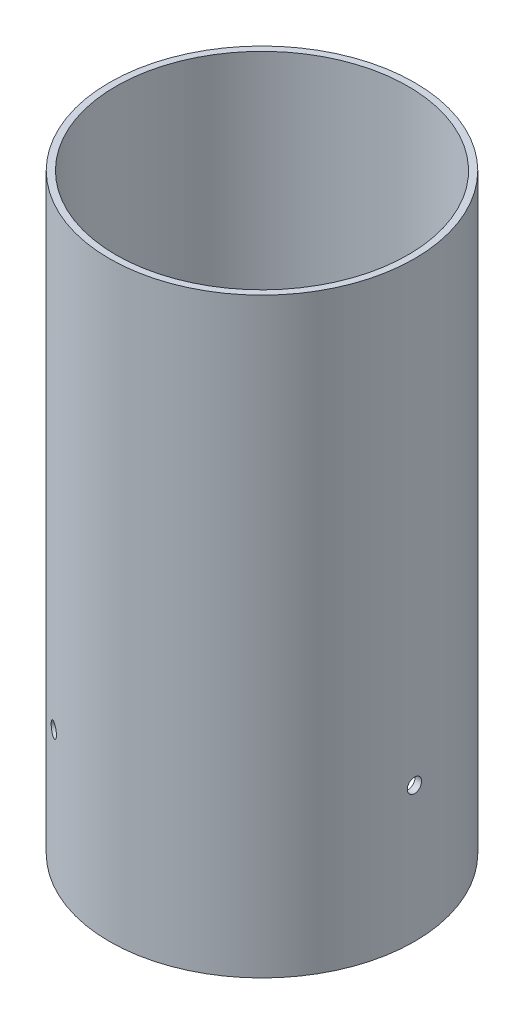
ISO-10303-21;
HEADER;
FILE_DESCRIPTION(('STEP AP214'),'2;1');
FILE_NAME('part.step','',(''),(''),'','','');
FILE_SCHEMA(('AUTOMOTIVE_DESIGN { 1 0 10303 214 1 1 1 1 }'));
ENDSEC;
DATA;
#1=APPLICATION_CONTEXT('core data for automotive mechanical design processes');
#2=APPLICATION_PROTOCOL_DEFINITION('international standard','automotive_design',2000,#1);
#3=PRODUCT_CONTEXT('',#1,'mechanical');
#4=PRODUCT('Part','Part','',(#3));
#5=PRODUCT_RELATED_PRODUCT_CATEGORY('part','',(#4));
#6=PRODUCT_DEFINITION_FORMATION('','',#4);
#7=PRODUCT_DEFINITION_CONTEXT('part definition',#1,'design');
#8=PRODUCT_DEFINITION('design','',#6,#7);
#9=PRODUCT_DEFINITION_SHAPE('','',#8);
#10=(LENGTH_UNIT() NAMED_UNIT(*) SI_UNIT(.MILLI.,.METRE.));
#11=(NAMED_UNIT(*) PLANE_ANGLE_UNIT() SI_UNIT($,.RADIAN.));
#12=(NAMED_UNIT(*) SI_UNIT($,.STERADIAN.) SOLID_ANGLE_UNIT());
#13=UNCERTAINTY_MEASURE_WITH_UNIT(LENGTH_MEASURE(1.E-05),#10,'distance_accuracy_value','');
#14=(GEOMETRIC_REPRESENTATION_CONTEXT(3) GLOBAL_UNCERTAINTY_ASSIGNED_CONTEXT((#13)) GLOBAL_UNIT_ASSIGNED_CONTEXT((#10,
#11,#12)) REPRESENTATION_CONTEXT('',''));
#15=CARTESIAN_POINT('',(0.,0.,0.));
#16=DIRECTION('',(0.,0.,1.));
#17=DIRECTION('',(1.,0.,0.));
#18=AXIS2_PLACEMENT_3D('',#15,#16,#17);
#19=CARTESIAN_POINT('',(0.,147.8153,0.));
#20=DIRECTION('',(0.,1.,0.));
#21=DIRECTION('',(0.,0.,1.));
#22=AXIS2_PLACEMENT_3D('',#19,#20,#21);
#23=PLANE('',#22);
#24=CARTESIAN_POINT('',(0.,147.8153,0.));
#25=DIRECTION('',(0.,1.,0.));
#26=DIRECTION('',(0.,0.,1.));
#27=AXIS2_PLACEMENT_3D('',#24,#25,#26);
#28=CIRCLE('',#27,38.1381);
#29=CARTESIAN_POINT('',(0.,147.8153,38.1381));
#30=VERTEX_POINT('',#29);
#31=EDGE_CURVE('E10',#30,#30,#28,.T.);
#32=ORIENTED_EDGE('',*,*,#31,.T.);
#33=EDGE_LOOP('',(#32));
#34=FACE_BOUND('',#33,.T.);
#35=CARTESIAN_POINT('',(0.,147.8153,0.));
#36=DIRECTION('',(0.,1.,0.));
#37=DIRECTION('',(0.,0.,1.));
#38=AXIS2_PLACEMENT_3D('',#35,#36,#37);
#39=CIRCLE('',#38,36.5125);
#40=CARTESIAN_POINT('',(0.,147.8153,36.5125));
#41=VERTEX_POINT('',#40);
#42=EDGE_CURVE('E47',#41,#41,#39,.T.);
#43=ORIENTED_EDGE('',*,*,#42,.F.);
#44=EDGE_LOOP('',(#43));
#45=FACE_BOUND('',#44,.T.);
#46=ADVANCED_FACE('F36',(#34,#45),#23,.T.);
#47=CARTESIAN_POINT('',(0.,0.,0.));
#48=DIRECTION('',(0.,1.,0.));
#49=DIRECTION('',(0.,0.,1.));
#50=AXIS2_PLACEMENT_3D('',#47,#48,#49);
#51=PLANE('',#50);
#52=CARTESIAN_POINT('',(0.,0.,0.));
#53=DIRECTION('',(0.,1.,0.));
#54=DIRECTION('',(0.,0.,1.));
#55=AXIS2_PLACEMENT_3D('',#52,#53,#54);
#56=CIRCLE('',#55,38.1381);
#57=CARTESIAN_POINT('',(0.,0.,38.1381));
#58=VERTEX_POINT('',#57);
#59=EDGE_CURVE('E40',#58,#58,#56,.T.);
#60=ORIENTED_EDGE('',*,*,#59,.F.);
#61=EDGE_LOOP('',(#60));
#62=FACE_BOUND('',#61,.T.);
#63=CARTESIAN_POINT('',(0.,0.,0.));
#64=DIRECTION('',(0.,1.,0.));
#65=DIRECTION('',(0.,0.,1.));
#66=AXIS2_PLACEMENT_3D('',#63,#64,#65);
#67=CIRCLE('',#66,36.5125);
#68=CARTESIAN_POINT('',(0.,0.,36.5125));
#69=VERTEX_POINT('',#68);
#70=EDGE_CURVE('E49',#69,#69,#67,.T.);
#71=ORIENTED_EDGE('',*,*,#70,.T.);
#72=EDGE_LOOP('',(#71));
#73=FACE_BOUND('',#72,.T.);
#74=ADVANCED_FACE('F119',(#62,#73),#51,.F.);
#75=CARTESIAN_POINT('',(0.,147.8153,0.));
#76=DIRECTION('',(0.,-1.,0.));
#77=DIRECTION('',(0.,0.,-1.));
#78=AXIS2_PLACEMENT_3D('',#75,#76,#77);
#79=CYLINDRICAL_SURFACE('',#78,38.1381);
#80=CARTESIAN_POINT('',(-17.5014632336155,33.8074,33.8852985274205));
#81=CARTESIAN_POINT('',(-17.501467349219,33.9076578687469,33.8852968008197));
#82=CARTESIAN_POINT('',(-17.508999065726,34.0079870339223,33.8814096230945));
#83=CARTESIAN_POINT('',(-17.5389215941936,34.205878197048,33.8659293942136));
#84=CARTESIAN_POINT('',(-17.5613299602515,34.3034367837977,33.85432723954));
#85=CARTESIAN_POINT('',(-17.6203141855438,34.4928914651225,33.8236647641002));
#86=CARTESIAN_POINT('',(-17.6568828784673,34.5847903967336,33.8046082158315));
#87=CARTESIAN_POINT('',(-17.7430638212488,34.7603432783211,33.7594536817781));
#88=CARTESIAN_POINT('',(-17.792672972035,34.8439991807722,33.7333573689586));
#89=CARTESIAN_POINT('',(-17.9034840121713,35.0007921425403,33.6746767440669));
#90=CARTESIAN_POINT('',(-17.9646950271793,35.0739208412828,33.6420873236829));
#91=CARTESIAN_POINT('',(-18.0968533022114,35.2075123586161,33.5711808496157));
#92=CARTESIAN_POINT('',(-18.1678009575859,35.2679746626434,33.5328635633504));
#93=CARTESIAN_POINT('',(-18.3173592830159,35.3745390488251,33.4514015191992));
#94=CARTESIAN_POINT('',(-18.3959733221843,35.4206347796843,33.4082546376291));
#95=CARTESIAN_POINT('',(-18.5585260587089,35.4971167209652,33.3182293245103));
#96=CARTESIAN_POINT('',(-18.6424647194058,35.5275030395305,33.2713509186521));
#97=CARTESIAN_POINT('',(-18.8131603751818,35.5716819567595,33.1751300658714));
#98=CARTESIAN_POINT('',(-18.8999152369714,35.5854868280182,33.1257894695229));
#99=CARTESIAN_POINT('',(-19.0738088012202,35.5961488477628,33.0259676432805));
#100=CARTESIAN_POINT('',(-19.1609475009398,35.5930061170072,32.9754864215167));
#101=CARTESIAN_POINT('',(-19.3330697199145,35.5698723474202,32.8748691177054));
#102=CARTESIAN_POINT('',(-19.418054875546,35.5498945218934,32.8247327960607));
#103=CARTESIAN_POINT('',(-19.583569892321,35.4936781366245,32.7262546252417));
#104=CARTESIAN_POINT('',(-19.6640997364757,35.4574395148824,32.6779127829103));
#105=CARTESIAN_POINT('',(-19.8185219457185,35.3697151326098,32.5844904179342));
#106=CARTESIAN_POINT('',(-19.892411671933,35.3182233448836,32.5394111932713));
#107=CARTESIAN_POINT('',(-20.0315166435133,35.2014587034356,32.4539625790467));
#108=CARTESIAN_POINT('',(-20.0967318355649,35.1361857650204,32.4135932184323));
#109=CARTESIAN_POINT('',(-20.2168010405188,34.9936369669281,32.3388411258981));
#110=CARTESIAN_POINT('',(-20.2716450461268,34.9163496440811,32.3044641786123));
#111=CARTESIAN_POINT('',(-20.369438174186,34.7520062782388,32.2428908495348));
#112=CARTESIAN_POINT('',(-20.4123872937555,34.6649502328769,32.2156944694826));
#113=CARTESIAN_POINT('',(-20.4852583357616,34.4835337335853,32.1694068226873));
#114=CARTESIAN_POINT('',(-20.5151798986683,34.3891730781501,32.1503157796327));
#115=CARTESIAN_POINT('',(-20.561206444117,34.1958290196872,32.1208999508396));
#116=CARTESIAN_POINT('',(-20.577311517821,34.0968456471649,32.1105751072611));
#117=CARTESIAN_POINT('',(-20.595273484249,33.8971665940379,32.0990575866162));
#118=CARTESIAN_POINT('',(-20.597143893939,33.7964726288875,32.0978562460472));
#119=CARTESIAN_POINT('',(-20.5866231403947,33.5961422470756,32.1046049164172));
#120=CARTESIAN_POINT('',(-20.5742320184312,33.4965058273547,32.1125549008735));
#121=CARTESIAN_POINT('',(-20.5355220520146,33.3011638380275,32.1373229722597));
#122=CARTESIAN_POINT('',(-20.50920939702,33.2054565419093,32.1541371182066));
#123=CARTESIAN_POINT('',(-20.4433503288636,33.0206364223301,32.196049659695));
#124=CARTESIAN_POINT('',(-20.4038038486634,32.9315236322774,32.2211480972021));
#125=CARTESIAN_POINT('',(-20.3124821865116,32.7623483055533,32.278795607632));
#126=CARTESIAN_POINT('',(-20.2606977969633,32.6822926507096,32.3113502899361));
#127=CARTESIAN_POINT('',(-20.1462864687058,32.5335732855632,32.3828094851312));
#128=CARTESIAN_POINT('',(-20.0836594686947,32.4649096396729,32.421714033923));
#129=CARTESIAN_POINT('',(-19.9491818321175,32.3408695739021,32.5046311874835));
#130=CARTESIAN_POINT('',(-19.8773240734296,32.2855035096205,32.5486477339441));
#131=CARTESIAN_POINT('',(-19.7263669675379,32.1897010321337,32.6403570320063));
#132=CARTESIAN_POINT('',(-19.6472676489548,32.1492645599254,32.6880497690783));
#133=CARTESIAN_POINT('',(-19.4840319330606,32.084487234282,32.7856096633245));
#134=CARTESIAN_POINT('',(-19.3998976295519,32.0601397402629,32.8354759143297));
#135=CARTESIAN_POINT('',(-19.2289060520162,32.028209756078,32.9359024547704));
#136=CARTESIAN_POINT('',(-19.1420487908613,32.0206271866717,32.9864627409244));
#137=CARTESIAN_POINT('',(-18.9681508668178,32.022443068198,33.0867645792259));
#138=CARTESIAN_POINT('',(-18.8811104591919,32.0318252655729,33.1365068690075));
#139=CARTESIAN_POINT('',(-18.7092530191418,32.0672707808457,33.2338423843089));
#140=CARTESIAN_POINT('',(-18.6244359909555,32.0933341305366,33.2814356057326));
#141=CARTESIAN_POINT('',(-18.4594798888871,32.1613988900873,33.3732106648531));
#142=CARTESIAN_POINT('',(-18.3793408605228,32.2034004549993,33.4173924693574));
#143=CARTESIAN_POINT('',(-18.2260878657308,32.3021463301724,33.5012243290482));
#144=CARTESIAN_POINT('',(-18.1529736764123,32.3588901724648,33.5408745280253));
#145=CARTESIAN_POINT('',(-18.015868143754,32.4855672360272,33.6147177026454));
#146=CARTESIAN_POINT('',(-17.9518846003812,32.5555116169684,33.6489060153489));
#147=CARTESIAN_POINT('',(-17.8350110289078,32.7066001733453,33.7109988811533));
#148=CARTESIAN_POINT('',(-17.7821237373999,32.7877471034271,33.7389018842759));
#149=CARTESIAN_POINT('',(-17.6890181436651,32.9589949189407,33.7878097201873));
#150=CARTESIAN_POINT('',(-17.6488112777457,33.0491037912539,33.8088083267147));
#151=CARTESIAN_POINT('',(-17.5823942894019,33.2355925870745,33.8433966689575));
#152=CARTESIAN_POINT('',(-17.5561676040917,33.3319649373638,33.8569951722755));
#153=CARTESIAN_POINT('',(-17.5254064854518,33.4920150071967,33.8729237871435));
#154=CARTESIAN_POINT('',(-17.516439932421,33.5546556126158,33.8775596798369));
#155=CARTESIAN_POINT('',(-17.5044670077013,33.6806546460333,33.8837475946384));
#156=CARTESIAN_POINT('',(-17.5014606315708,33.7440130734968,33.8852996190447));
#157=CARTESIAN_POINT('',(-17.5014632336155,33.8074,33.8852985274205));
#158=B_SPLINE_CURVE_WITH_KNOTS('',3,(#80,#81,#82,#83,#84,#85,#86,#87,#88,#89,#90,#91,#92,#93,
#94,#95,#96,#97,#98,#99,#100,#101,#102,#103,#104,#105,#106,#107,#108,#109,#110,#111,#112,#113,
#114,#115,#116,#117,#118,#119,#120,#121,#122,#123,#124,#125,#126,#127,#128,#129,#130,#131,#132,
#133,#134,#135,#136,#137,#138,#139,#140,#141,#142,#143,#144,#145,#146,#147,#148,#149,#150,#151,
#152,#153,#154,#155,#156,#157),.UNSPECIFIED.,.T.,.F.,(4,2,2,2,2,2,2,2,2,2,2,2,2,2,2,2,2,2,2,2,2,
2,2,2,2,2,2,2,2,2,2,2,2,2,2,2,2,2,4),(0.,0.30054222269631,0.601439709975831,0.902185116537959,
1.20285911531018,1.50377060360109,1.80469431384009,2.1057508708664,2.40680535539062,
2.70763687982766,3.00846626072007,3.30905975033448,3.60965438607756,3.9103679587644,
4.21108337957105,4.51208750037112,4.8130916940894,5.11410419428654,5.41511470836723,
5.71583935288382,6.01656312714919,6.31715331302587,6.61774502161876,6.91856361444067,
7.21938390808641,7.52043771383772,7.82149032978512,8.12241861117601,8.42334547020756,
8.72398417080085,9.0246234443924,9.32526564277497,9.62589829894312,9.92678625628239,
10.2277483325598,10.5289810714218,10.8298561299779,11.0198707614112,11.2098852512392),.UNSPECIFIED.);
#159=CARTESIAN_POINT('',(-17.5014632336155,33.8074,33.8852985274205));
#160=VERTEX_POINT('',#159);
#161=EDGE_CURVE('E101',#160,#160,#158,.T.);
#162=ORIENTED_EDGE('',*,*,#161,.F.);
#163=EDGE_LOOP('',(#162));
#164=FACE_BOUND('',#163,.T.);
#165=CARTESIAN_POINT('',(-20.5947977227576,33.8074,-32.0993610274207));
#166=CARTESIAN_POINT('',(-20.5947941696758,33.9076578687469,-32.0993637283375));
#167=CARTESIAN_POINT('',(-20.5876619167632,34.0079870339223,-32.1039427973041));
#168=CARTESIAN_POINT('',(-20.5592943810622,34.205878197048,-32.122116352662));
#169=CARTESIAN_POINT('',(-20.5380424373473,34.3034367837977,-32.1357214895887));
#170=CARTESIAN_POINT('',(-20.4819958420273,34.4928914651225,-32.1714720893944));
#171=CARTESIAN_POINT('',(-20.4472080406564,34.5847903967336,-32.193613232315));
#172=CARTESIAN_POINT('',(-20.3650125956794,34.7603432783211,-32.2456708510592));
#173=CARTESIAN_POINT('',(-20.3176079504394,34.8439991807721,-32.2755854794905));
#174=CARTESIAN_POINT('',(-20.2113835185052,35.0007921425403,-32.3422103428224));
#175=CARTESIAN_POINT('',(-20.152554745054,35.0739208412828,-32.3789259266187));
#176=CARTESIAN_POINT('',(-20.025068799703,35.2075123586161,-32.4579251130833));
#177=CARTESIAN_POINT('',(-19.9564112287059,35.2679746626434,-32.500208941844));
#178=CARTESIAN_POINT('',(-19.8110838663118,35.3745390488251,-32.5889992289381));
#179=CARTESIAN_POINT('',(-19.7344105511938,35.4206347796843,-32.6355075431671));
#180=CARTESIAN_POINT('',(-19.575169974787,35.4971167209652,-32.7312696858926));
#181=CARTESIAN_POINT('',(-19.4926027540764,35.5275030395305,-32.7805234954867));
#182=CARTESIAN_POINT('',(-19.3239252233066,35.5716819567595,-32.880239843314));
#183=CARTESIAN_POINT('',(-19.237817582536,35.5854868280182,-32.9307014593514));
#184=CARTESIAN_POINT('',(-19.0644225630336,35.5961488477628,-33.0313867904242));
#185=CARTESIAN_POINT('',(-18.9771351927122,35.5930061170072,-33.0816105071523));
#186=CARTESIAN_POINT('',(-18.803936942064,35.5698723474202,-33.1803640694344));
#187=CARTESIAN_POINT('',(-18.7180250360516,35.5498945218934,-33.2288952123336));
#188=CARTESIAN_POINT('',(-18.5499829300166,35.4936781366245,-33.322996336159));
#189=CARTESIAN_POINT('',(-18.4678527444145,35.4574395148824,-33.3685663057941));
#190=CARTESIAN_POINT('',(-18.3097354984422,35.3697151326098,-33.4555886794188));
#191=CARTESIAN_POINT('',(-18.233750881594,35.3182233448836,-33.4970394470678));
#192=CARTESIAN_POINT('',(-18.0901977251672,35.2014587034356,-33.5747835791368));
#193=CARTESIAN_POINT('',(-18.0226292373148,35.1361857650204,-33.6110769118589));
#194=CARTESIAN_POINT('',(-17.8978574237172,34.9936369669281,-33.6776838472941));
#195=CARTESIAN_POINT('',(-17.8406641112591,34.9163496440811,-33.7079916757531));
#196=CARTESIAN_POINT('',(-17.7384434800528,34.7520062782388,-33.7618963444291));
#197=CARTESIAN_POINT('',(-17.6934161642519,34.6649502328769,-33.7854931830203));
#198=CARTESIAN_POINT('',(-17.6168943652427,34.4835337335853,-33.8254575332002));
#199=CARTESIAN_POINT('',(-17.5854002555193,34.3891730781501,-33.841824845271));
#200=CARTESIAN_POINT('',(-17.5369121277868,34.1958290196872,-33.8669770884814));
#201=CARTESIAN_POINT('',(-17.5199180141057,34.0968456471649,-33.8757620696497));
#202=CARTESIAN_POINT('',(-17.5009625654246,33.8971665940379,-33.8855588285559));
#203=CARTESIAN_POINT('',(-17.4989869691283,33.7964726288875,-33.8865779805784));
#204=CARTESIAN_POINT('',(-17.5100918658825,33.5961422470756,-33.8808410759271));
#205=CARTESIAN_POINT('',(-17.5231723153632,33.4965058273547,-33.8740850417534));
#206=CARTESIAN_POINT('',(-17.5639770775947,33.3011638380275,-33.8529452631501));
#207=CARTESIAN_POINT('',(-17.5916948826249,33.2054565419094,-33.8385649084572));
#208=CARTESIAN_POINT('',(-17.6609217423693,33.0206364223301,-33.8024855531084));
#209=CARTESIAN_POINT('',(-17.7024308669458,32.9315236322775,-33.7807865153784));
#210=CARTESIAN_POINT('',(-17.7980159065189,32.7623483055533,-33.730523391254));
#211=CARTESIAN_POINT('',(-17.8521012831806,32.6822926507096,-33.7019541355377));
#212=CARTESIAN_POINT('',(-17.9711924256823,32.5335732855632,-33.6386006163836));
#213=CARTESIAN_POINT('',(-18.0361982532643,32.4649096396729,-33.603816317807));
#214=CARTESIAN_POINT('',(-18.1752454329457,32.3408695739021,-33.5288138450706));
#215=CARTESIAN_POINT('',(-18.2492937597114,32.2855035096205,-33.4885914738182));
#216=CARTESIAN_POINT('',(-18.4041948945424,32.1897010321337,-33.4037134342652));
#217=CARTESIAN_POINT('',(-18.4850476757143,32.1492645599254,-33.3590577834863));
#218=CARTESIAN_POINT('',(-18.6511548804692,32.084487234282,-33.2664714538401));
#219=CARTESIAN_POINT('',(-18.7364074723854,32.0601397402629,-33.2185421351744));
#220=CARTESIAN_POINT('',(-18.9088751963892,32.028209756078,-33.1206723554156));
#221=CARTESIAN_POINT('',(-18.9960903191986,32.0206271866717,-33.0707319038294));
#222=CARTESIAN_POINT('',(-19.1699032212357,32.022443068198,-32.970282803093));
#223=CARTESIAN_POINT('',(-19.2565015116419,32.0318252655729,-32.9197747438241));
#224=CARTESIAN_POINT('',(-19.4267252606085,32.0672707808457,-32.8196095925621));
#225=CARTESIAN_POINT('',(-19.5103507135025,32.0933341305366,-32.7699525021911));
#226=CARTESIAN_POINT('',(-19.6723082971688,32.1613988900873,-32.6729838568508));
#227=CARTESIAN_POINT('',(-19.7506403764367,32.2034004549993,-32.6256723247049));
#228=CARTESIAN_POINT('',(-19.8998673939714,32.3021463301724,-32.5348672678544));
#229=CARTESIAN_POINT('',(-19.9707625682099,32.3588901724648,-32.491373622016));
#230=CARTESIAN_POINT('',(-20.1032653996562,32.4855672360272,-32.4095583350445));
#231=CARTESIAN_POINT('',(-20.1648651186564,32.5555116169684,-32.3712411174113));
#232=CARTESIAN_POINT('',(-20.2770759035736,32.7066001733453,-32.3010720683865));
#233=CARTESIAN_POINT('',(-20.3276842588735,32.7877471034271,-32.2692218319646));
#234=CARTESIAN_POINT('',(-20.4165924840843,32.9589949189407,-32.2130439405115));
#235=CARTESIAN_POINT('',(-20.4548812437407,33.0491037912539,-32.1887230764825));
#236=CARTESIAN_POINT('',(-20.5180441209697,33.2355925870745,-32.1484984484553));
#237=CARTESIAN_POINT('',(-20.5429341129517,33.3319649373638,-32.1325847243787));
#238=CARTESIAN_POINT('',(-20.5721092573945,33.4920150071967,-32.1139091216217));
#239=CARTESIAN_POINT('',(-20.5806073347516,33.5546556126158,-32.1084618052593));
#240=CARTESIAN_POINT('',(-20.5919526885259,33.6806546460333,-32.1011869056952));
#241=CARTESIAN_POINT('',(-20.5947999691543,33.7440130734968,-32.099359319796));
#242=CARTESIAN_POINT('',(-20.5947977227576,33.8074,-32.0993610274207));
#243=B_SPLINE_CURVE_WITH_KNOTS('',3,(#165,#166,#167,#168,#169,#170,#171,#172,#173,#174,#175,
#176,#177,#178,#179,#180,#181,#182,#183,#184,#185,#186,#187,#188,#189,#190,#191,#192,#193,#194,
#195,#196,#197,#198,#199,#200,#201,#202,#203,#204,#205,#206,#207,#208,#209,#210,#211,#212,#213,
#214,#215,#216,#217,#218,#219,#220,#221,#222,#223,#224,#225,#226,#227,#228,#229,#230,#231,#232,
#233,#234,#235,#236,#237,#238,#239,#240,#241,#242),.UNSPECIFIED.,.T.,.F.,(4,2,2,2,2,2,2,2,2,2,2,
2,2,2,2,2,2,2,2,2,2,2,2,2,2,2,2,2,2,2,2,2,2,2,2,2,2,2,4),(0.,0.30054222269631,0.601439709975832,
0.902185116537959,1.20285911531018,1.50377060360109,1.80469431384009,2.10575087086639,
2.40680535539062,2.70763687982766,3.00846626072008,3.30905975033448,3.60965438607756,
3.9103679587644,4.21108337957105,4.51208750037112,4.81309169408941,5.11410419428654,
5.41511470836724,5.71583935288383,6.01656312714919,6.31715331302586,6.61774502161876,
6.91856361444067,7.21938390808641,7.52043771383773,7.82149032978512,8.12241861117601,
8.42334547020756,8.72398417080085,9.0246234443924,9.32526564277497,9.62589829894312,
9.92678625628239,10.2277483325598,10.5289810714218,10.8298561299779,11.0198707614112,
11.2098852512392),.UNSPECIFIED.);
#244=CARTESIAN_POINT('',(-20.5947977227576,33.8074,-32.0993610274207));
#245=VERTEX_POINT('',#244);
#246=EDGE_CURVE('E78',#245,#245,#243,.T.);
#247=ORIENTED_EDGE('',*,*,#246,.F.);
#248=EDGE_LOOP('',(#247));
#249=FACE_BOUND('',#248,.T.);
#250=CARTESIAN_POINT('',(38.0962609563733,33.8074,-1.7859375));
#251=CARTESIAN_POINT('',(38.0962615188949,33.9076578687469,-1.78593307248244));
#252=CARTESIAN_POINT('',(38.0966609824894,34.0079870339223,-1.77746682579068));
#253=CARTESIAN_POINT('',(38.0982159752559,34.205878197048,-1.74381304155182));
#254=CARTESIAN_POINT('',(38.0993723975989,34.3034367837977,-1.71860574995165));
#255=CARTESIAN_POINT('',(38.1023100275712,34.4928914651225,-1.65219267470606));
#256=CARTESIAN_POINT('',(38.1040909191239,34.5847903967336,-1.61099498351676));
#257=CARTESIAN_POINT('',(38.1080764169283,34.7603432783211,-1.5137828307192));
#258=CARTESIAN_POINT('',(38.1102809224746,34.8439991807722,-1.45777188946837));
#259=CARTESIAN_POINT('',(38.1148675306766,35.0007921425403,-1.33246640124479));
#260=CARTESIAN_POINT('',(38.1172497722334,35.0739208412828,-1.26316139706439));
#261=CARTESIAN_POINT('',(38.1219221019145,35.2075123586161,-1.11325573653268));
#262=CARTESIAN_POINT('',(38.124212186292,35.2679746626434,-1.03265462150673));
#263=CARTESIAN_POINT('',(38.1284431493278,35.3745390488251,-0.862402290261317));
#264=CARTESIAN_POINT('',(38.1303838733782,35.4206347796843,-0.772747094462273));
#265=CARTESIAN_POINT('',(38.133696033496,35.4971167209652,-0.586959638617963));
#266=CARTESIAN_POINT('',(38.1350674734823,35.5275030395305,-0.490827423165673));
#267=CARTESIAN_POINT('',(38.1370855984884,35.5716819567595,-0.294890222557718));
#268=CARTESIAN_POINT('',(38.1377328195076,35.5854868280182,-0.195088010171746));
#269=CARTESIAN_POINT('',(38.1382313642539,35.5961488477628,0.00541914714346489));
#270=CARTESIAN_POINT('',(38.1380826936522,35.5930061170072,0.106124085635308));
#271=CARTESIAN_POINT('',(38.1370066619786,35.5698723474202,0.305494951728732));
#272=CARTESIAN_POINT('',(38.1360799115978,35.5498945218934,0.404162416272602));
#273=CARTESIAN_POINT('',(38.1335528223378,35.4936781366245,0.596741710917084));
#274=CARTESIAN_POINT('',(38.1319524808904,35.4574395148824,0.690653522883571));
#275=CARTESIAN_POINT('',(38.1282574441608,35.3697151326098,0.871098261484329));
#276=CARTESIAN_POINT('',(38.1261625535272,35.3182233448836,0.957628253796231));
#277=CARTESIAN_POINT('',(38.1217143686807,35.2014587034356,1.12082100008981));
#278=CARTESIAN_POINT('',(38.1193610728798,35.1361857650204,1.19748369342633));
#279=CARTESIAN_POINT('',(38.1146584642361,34.9936369669281,1.33884272139567));
#280=CARTESIAN_POINT('',(38.1123091573861,34.9163496440811,1.40352749714048));
#281=CARTESIAN_POINT('',(38.107881654239,34.7520062782388,1.519005494894));
#282=CARTESIAN_POINT('',(38.1058034580075,34.6649502328769,1.56979871353748));
#283=CARTESIAN_POINT('',(38.1021527010044,34.4835337335853,1.65605071051264));
#284=CARTESIAN_POINT('',(38.1005801541877,34.3891730781501,1.69150906563811));
#285=CARTESIAN_POINT('',(38.0981185719039,34.1958290196872,1.74607713764162));
#286=CARTESIAN_POINT('',(38.0972295319268,34.0968456471649,1.76518696238839));
#287=CARTESIAN_POINT('',(38.0962360496738,33.8971665940379,1.78650124193938));
#288=CARTESIAN_POINT('',(38.0961308630674,33.7964726288875,1.78872173453091));
#289=CARTESIAN_POINT('',(38.0967150062774,33.5961422470756,1.77623615950963));
#290=CARTESIAN_POINT('',(38.0974043337945,33.4965058273547,1.76153014087967));
#291=CARTESIAN_POINT('',(38.0994991296094,33.3011638380275,1.71562229089013));
#292=CARTESIAN_POINT('',(38.1009042796451,33.2054565419094,1.68442779025039));
#293=CARTESIAN_POINT('',(38.104272071233,33.0206364223301,1.60643589341315));
#294=CARTESIAN_POINT('',(38.1062347156094,32.9315236322775,1.55963841817599));
#295=CARTESIAN_POINT('',(38.1104980930306,32.7623483055533,1.45172778362177));
#296=CARTESIAN_POINT('',(38.112799080144,32.6822926507096,1.39060384560135));
#297=CARTESIAN_POINT('',(38.1174788943882,32.5335732855632,1.2557911312521));
#298=CARTESIAN_POINT('',(38.1198577219591,32.4649096396729,1.18210228388381));
#299=CARTESIAN_POINT('',(38.1244272650634,32.3408695739021,1.02418265758683));
#300=CARTESIAN_POINT('',(38.1266178331412,32.2855035096205,0.939943739873793));
#301=CARTESIAN_POINT('',(38.1305618620804,32.1897010321337,0.763356402258667));
#302=CARTESIAN_POINT('',(38.1323153246693,32.1492645599254,0.671008014407706));
#303=CARTESIAN_POINT('',(38.1351868135299,32.084487234282,0.480861790515269));
#304=CARTESIAN_POINT('',(38.1363051019375,32.0601397402629,0.383066220844478));
#305=CARTESIAN_POINT('',(38.1377812484055,32.028209756078,0.184769900644984));
#306=CARTESIAN_POINT('',(38.1381391100601,32.0206271866717,0.084269162904701));
#307=CARTESIAN_POINT('',(38.1380540880537,32.022443068198,-0.116481776133133));
#308=CARTESIAN_POINT('',(38.137611970834,32.0318252655729,-0.21673212518367));
#309=CARTESIAN_POINT('',(38.1359782797504,32.0672707808457,-0.414232791747113));
#310=CARTESIAN_POINT('',(38.1347867044582,32.0933341305366,-0.511483103541785));
#311=CARTESIAN_POINT('',(38.1317881860561,32.1613988900873,-0.700226808002504));
#312=CARTESIAN_POINT('',(38.1299812369597,32.2034004549993,-0.791720144652742));
#313=CARTESIAN_POINT('',(38.1259552597024,32.3021463301724,-0.966357061194046));
#314=CARTESIAN_POINT('',(38.1237362446224,32.3588901724648,-1.04950090600953));
#315=CARTESIAN_POINT('',(38.1191335434104,32.4855672360272,-1.20515936760108));
#316=CARTESIAN_POINT('',(38.1167497190378,32.5555116169684,-1.27766489793787));
#317=CARTESIAN_POINT('',(38.1120869324815,32.7066001733453,-1.40992681276709));
#318=CARTESIAN_POINT('',(38.1098079962735,32.7877471034271,-1.46968005231157));
#319=CARTESIAN_POINT('',(38.1056106277495,32.9589949189407,-1.57476577967603));
#320=CARTESIAN_POINT('',(38.1036925214866,33.0491037912539,-1.62008525023241));
#321=CARTESIAN_POINT('',(38.1004384103717,33.2355925870745,-1.69489822050243));
#322=CARTESIAN_POINT('',(38.0991017170436,33.3319649373638,-1.72441044789715));
#323=CARTESIAN_POINT('',(38.0975157428464,33.4920150071967,-1.75901466552216));
#324=CARTESIAN_POINT('',(38.0970472671726,33.5546556126158,-1.76909787457792));
#325=CARTESIAN_POINT('',(38.0964196962274,33.6806546460333,-1.78256068894342));
#326=CARTESIAN_POINT('',(38.0962606007252,33.7440130734968,-1.78594029924891));
#327=CARTESIAN_POINT('',(38.0962609563733,33.8074,-1.7859375));
#328=B_SPLINE_CURVE_WITH_KNOTS('',3,(#250,#251,#252,#253,#254,#255,#256,#257,#258,#259,#260,
#261,#262,#263,#264,#265,#266,#267,#268,#269,#270,#271,#272,#273,#274,#275,#276,#277,#278,#279,
#280,#281,#282,#283,#284,#285,#286,#287,#288,#289,#290,#291,#292,#293,#294,#295,#296,#297,#298,
#299,#300,#301,#302,#303,#304,#305,#306,#307,#308,#309,#310,#311,#312,#313,#314,#315,#316,#317,
#318,#319,#320,#321,#322,#323,#324,#325,#326,#327),.UNSPECIFIED.,.T.,.F.,(4,2,2,2,2,2,2,2,2,2,2,
2,2,2,2,2,2,2,2,2,2,2,2,2,2,2,2,2,2,2,2,2,2,2,2,2,2,2,4),(0.,0.30054222269631,0.601439709975833,
0.902185116537965,1.20285911531018,1.50377060360109,1.80469431384009,2.10575087086639,
2.40680535539062,2.70763687982766,3.00846626072007,3.30905975033448,3.60965438607756,
3.91036795876441,4.21108337957105,4.51208750037112,4.81309169408941,5.11410419428654,
5.41511470836724,5.71583935288383,6.01656312714919,6.31715331302585,6.61774502161876,
6.91856361444067,7.21938390808641,7.52043771383772,7.82149032978512,8.12241861117601,
8.42334547020756,8.72398417080085,9.0246234443924,9.32526564277497,9.62589829894312,
9.92678625628239,10.2277483325598,10.5289810714218,10.8298561299779,11.0198707614112,
11.2098852512392),.UNSPECIFIED.);
#329=CARTESIAN_POINT('',(38.0962609563733,33.8074,-1.7859375));
#330=VERTEX_POINT('',#329);
#331=EDGE_CURVE('E62',#330,#330,#328,.T.);
#332=ORIENTED_EDGE('',*,*,#331,.F.);
#333=EDGE_LOOP('',(#332));
#334=FACE_BOUND('',#333,.T.);
#335=ORIENTED_EDGE('',*,*,#31,.F.);
#336=EDGE_LOOP('',(#335));
#337=FACE_BOUND('',#336,.T.);
#338=ORIENTED_EDGE('',*,*,#59,.T.);
#339=EDGE_LOOP('',(#338));
#340=FACE_BOUND('',#339,.T.);
#341=ADVANCED_FACE('F38',(#164,#249,#334,#337,#340),#79,.T.);
#342=CARTESIAN_POINT('',(0.,147.8153,0.));
#343=DIRECTION('',(0.,-1.,0.));
#344=DIRECTION('',(0.,0.,-1.));
#345=AXIS2_PLACEMENT_3D('',#342,#343,#344);
#346=CYLINDRICAL_SURFACE('',#345,36.5125);
#347=CARTESIAN_POINT('',(-16.6877307678126,33.8074,32.4758725528815));
#348=CARTESIAN_POINT('',(-16.687734894034,33.9076524942413,32.4758708487192));
#349=CARTESIAN_POINT('',(-16.6952747189043,34.0079761535348,32.4719995230256));
#350=CARTESIAN_POINT('',(-16.7252285602174,34.205856087648,32.4565811301846));
#351=CARTESIAN_POINT('',(-16.7476601184195,34.3034089571194,32.4450250106855));
#352=CARTESIAN_POINT('',(-16.8067025521695,34.4928521743818,32.414479850027));
#353=CARTESIAN_POINT('',(-16.8433062190425,34.5847453734778,32.3954945876654));
#354=CARTESIAN_POINT('',(-16.9295644540327,34.7602879247765,32.3505001263435));
#355=CARTESIAN_POINT('',(-16.9792159344468,34.8439392209554,32.3244925891313));
#356=CARTESIAN_POINT('',(-17.0901173626573,35.0007299309485,32.2659955161129));
#357=CARTESIAN_POINT('',(-17.1513771592365,35.0738603252041,32.2335004748843));
#358=CARTESIAN_POINT('',(-17.2836312210177,35.2074564680845,32.1627790982441));
#359=CARTESIAN_POINT('',(-17.3546258827149,35.2679217006111,32.1245525293849));
#360=CARTESIAN_POINT('',(-17.5042745439388,35.3744955098075,32.0432562693863));
#361=CARTESIAN_POINT('',(-17.5829322297808,35.420597131617,32.0001842457731));
#362=CARTESIAN_POINT('',(-17.7455613037914,35.4970904061227,31.9102857075174));
#363=CARTESIAN_POINT('',(-17.829532653014,35.527482173948,31.8634592203924));
#364=CARTESIAN_POINT('',(-18.0002731950428,35.5716693977292,31.7673166502914));
#365=CARTESIAN_POINT('',(-18.0870400721756,35.5854782447568,31.7180026096497));
#366=CARTESIAN_POINT('',(-18.2609407297262,35.5961489674964,31.6182028073521));
#367=CARTESIAN_POINT('',(-18.348074507347,35.5930109721574,31.5677170546145));
#368=CARTESIAN_POINT('',(-18.5201638246828,35.5698882070027,31.467064037214));
#369=CARTESIAN_POINT('',(-18.6051211641589,35.5499178523158,31.4168965370283));
#370=CARTESIAN_POINT('',(-18.7705666797176,35.4937195967668,31.3183294783321));
#371=CARTESIAN_POINT('',(-18.8510548376546,35.4574916299016,31.2699299269999));
#372=CARTESIAN_POINT('',(-19.0053872351895,35.3697900856106,31.1763703524817));
#373=CARTESIAN_POINT('',(-19.0792285935032,35.318309937702,31.1312117358936));
#374=CARTESIAN_POINT('',(-19.2182331711668,35.201570166033,31.045593001796));
#375=CARTESIAN_POINT('',(-19.2833963320112,35.1363104493827,31.0051329159629));
#376=CARTESIAN_POINT('',(-19.4033695763522,34.9937825254812,30.9301943906912));
#377=CARTESIAN_POINT('',(-19.4581687443805,34.9165018119395,30.895722260913));
#378=CARTESIAN_POINT('',(-19.5558791454023,34.7521695558778,30.8339682636942));
#379=CARTESIAN_POINT('',(-19.5987903753372,34.665118010844,30.8066863981034));
#380=CARTESIAN_POINT('',(-19.6715975421787,34.4837075898271,30.7602467544291));
#381=CARTESIAN_POINT('',(-19.7014930803861,34.3893484901017,30.7410892252124));
#382=CARTESIAN_POINT('',(-19.7474826018266,34.1960048894091,30.7115668820616));
#383=CARTESIAN_POINT('',(-19.7635766844002,34.0970204217398,30.7012020048396));
#384=CARTESIAN_POINT('',(-19.7815326245429,33.8973457102865,30.6896357051856));
#385=CARTESIAN_POINT('',(-19.7834092109276,33.7966573401288,30.6884247995705));
#386=CARTESIAN_POINT('',(-19.7729199789553,33.5963364695899,30.6951841366732));
#387=CARTESIAN_POINT('',(-19.7605542056371,33.4967039658708,30.7031543503574));
#388=CARTESIAN_POINT('',(-19.7219131158681,33.3013721561737,30.7279892106396));
#389=CARTESIAN_POINT('',(-19.695644550285,33.2056709655263,30.7448495403924));
#390=CARTESIAN_POINT('',(-19.6298885464345,33.0208603422332,30.786874567353));
#391=CARTESIAN_POINT('',(-19.5904010350053,32.9317509460739,30.8120393105225));
#392=CARTESIAN_POINT('',(-19.4992037624182,32.7625728956644,30.8698334055762));
#393=CARTESIAN_POINT('',(-19.4474839655503,32.6825117449797,30.9024688859527));
#394=CARTESIAN_POINT('',(-19.3332032983535,32.5337782994509,30.9740930769361));
#395=CARTESIAN_POINT('',(-19.2706423615222,32.4651060744746,31.0130818265156));
#396=CARTESIAN_POINT('',(-19.1362866939165,32.3410410613286,31.0961640674315));
#397=CARTESIAN_POINT('',(-19.0644841844913,32.2856595737907,31.1402618558985));
#398=CARTESIAN_POINT('',(-18.9136248145249,32.1898253648867,31.2321187453128));
#399=CARTESIAN_POINT('',(-18.8345679845436,32.1493725806352,31.2798778308362));
#400=CARTESIAN_POINT('',(-18.6714029045032,32.0845638505003,31.3775460922595));
#401=CARTESIAN_POINT('',(-18.5872969436135,32.0602006691639,31.4274542909384));
#402=CARTESIAN_POINT('',(-18.4163423976937,32.0282390295947,31.5279370627727));
#403=CARTESIAN_POINT('',(-18.329493827261,32.0206404821471,31.5785116323806));
#404=CARTESIAN_POINT('',(-18.1556007588238,32.0224246637604,31.678808086799));
#405=CARTESIAN_POINT('',(-18.0685565602443,32.0317896628802,31.7285308071196));
#406=CARTESIAN_POINT('',(-17.8966724611017,32.0671984586725,31.825799701844));
#407=CARTESIAN_POINT('',(-17.8118325647086,32.0932422868953,31.8733458721303));
#408=CARTESIAN_POINT('',(-17.6468143737763,32.1612658647812,31.9650045317767));
#409=CARTESIAN_POINT('',(-17.5666361175233,32.2032457453066,32.0091169929365));
#410=CARTESIAN_POINT('',(-17.4132919157933,32.3019466142615,32.0927960813912));
#411=CARTESIAN_POINT('',(-17.340125752591,32.3586671447909,32.1323628498373));
#412=CARTESIAN_POINT('',(-17.202902270451,32.485302401285,32.2060381252149));
#413=CARTESIAN_POINT('',(-17.1388535389764,32.5552294237629,32.2401414900546));
#414=CARTESIAN_POINT('',(-17.0218490246527,32.7062857978436,32.3020697005042));
#415=CARTESIAN_POINT('',(-16.9688959761221,32.7874179025711,32.3298929986421));
#416=CARTESIAN_POINT('',(-16.8756624281285,32.9586430546022,32.3786573748688));
#417=CARTESIAN_POINT('',(-16.8353938697942,33.0487444411883,32.3995919687813));
#418=CARTESIAN_POINT('',(-16.7688657476846,33.2352230871261,32.434074907404));
#419=CARTESIAN_POINT('',(-16.7425896262849,33.3315927767438,32.4476319825474));
#420=CARTESIAN_POINT('',(-16.7117500353616,33.4917015852751,32.4635215976089));
#421=CARTESIAN_POINT('',(-16.7027550693519,33.5544034921245,32.4681486335632));
#422=CARTESIAN_POINT('',(-16.6907441322637,33.6805274308069,32.4743246492297));
#423=CARTESIAN_POINT('',(-16.6877281562969,33.7439494620511,32.4758736314583));
#424=CARTESIAN_POINT('',(-16.6877307678126,33.8074,32.4758725528815));
#425=B_SPLINE_CURVE_WITH_KNOTS('',3,(#347,#348,#349,#350,#351,#352,#353,#354,#355,#356,#357,
#358,#359,#360,#361,#362,#363,#364,#365,#366,#367,#368,#369,#370,#371,#372,#373,#374,#375,#376,
#377,#378,#379,#380,#381,#382,#383,#384,#385,#386,#387,#388,#389,#390,#391,#392,#393,#394,#395,
#396,#397,#398,#399,#400,#401,#402,#403,#404,#405,#406,#407,#408,#409,#410,#411,#412,#413,#414,
#415,#416,#417,#418,#419,#420,#421,#422,#423,#424),.UNSPECIFIED.,.T.,.F.,(4,2,2,2,2,2,2,2,2,2,2,
2,2,2,2,2,2,2,2,2,2,2,2,2,2,2,2,2,2,2,2,2,2,2,2,2,2,2,4),(0.,0.300525864910744,
0.601406364738192,0.902134021660894,1.20279057680056,1.50370336785932,1.8046284185612,
2.10569895154031,2.40676727810439,2.70759232156549,3.00841507604152,3.30898046921384,
3.60954708264206,3.91024336581389,4.21094167608044,4.51195494257795,4.81296828651917,
5.11399085051239,5.41501124778096,5.71571975602545,6.01642731333721,6.31698898794435,
6.61755232607057,6.9183631154498,7.2191757501461,7.52024325584009,7.82130949330748,
8.12224024970756,8.42316940466808,8.72378421628565,9.02439959656144,9.32501744545925,
9.62562595714973,9.92651575661407,10.2274796176283,10.5287259638893,10.829615040678,
11.0198202174229,11.2100252386589),.UNSPECIFIED.);
#426=CARTESIAN_POINT('',(-16.6877307678126,33.8074,32.4758725528815));
#427=VERTEX_POINT('',#426);
#428=EDGE_CURVE('E84',#427,#427,#425,.T.);
#429=ORIENTED_EDGE('',*,*,#428,.T.);
#430=EDGE_LOOP('',(#429));
#431=FACE_BOUND('',#430,.T.);
#432=CARTESIAN_POINT('',(-19.7810652569547,33.8074,-30.6899350528817));
#433=CARTESIAN_POINT('',(-19.7810617179962,33.9076524942413,-30.6899377742131));
#434=CARTESIAN_POINT('',(-19.7739391391641,34.0079761535348,-30.6945317912441));
#435=CARTESIAN_POINT('',(-19.7456094986217,34.205856087648,-30.7127633823417));
#436=CARTESIAN_POINT('',(-19.7243858264652,34.3034089571194,-30.7264116218416));
#437=CARTESIAN_POINT('',(-19.6684117244973,34.4928521743818,-30.7622712890411));
#438=CARTESIAN_POINT('',(-19.6336681715581,34.5847453734778,-30.784478363244));
#439=CARTESIAN_POINT('',(-19.5515727075287,34.7602879247765,-30.8366829553702));
#440=CARTESIAN_POINT('',(-19.5042237794059,34.8439392209554,-30.8666786301382));
#441=CARTESIAN_POINT('',(-19.3981131140198,35.0007299309485,-30.9334735477753));
#442=CARTESIAN_POINT('',(-19.3393416845292,35.0738603252041,-30.9702785672293));
#443=CARTESIAN_POINT('',(-19.2119681448776,35.2074564680845,-31.0494532561653));
#444=CARTESIAN_POINT('',(-19.1433656342974,35.2679217006111,-31.0918231522985));
#445=CARTESIAN_POINT('',(-18.998136677294,35.3744955098075,-31.1807745645615));
#446=CARTESIAN_POINT('',(-18.9215063677315,35.420597131617,-31.2273581068969));
#447=CARTESIAN_POINT('',(-18.7623374128337,35.4970904061226,-31.3232497472562));
#448=CARTESIAN_POINT('',(-18.6797988108022,35.527482173948,-31.3725578253105));
#449=CARTESIAN_POINT('',(-18.5111666316952,35.5716693977292,-31.4723521871129));
#450=CARTESIAN_POINT('',(-18.4250759811698,35.5854782447568,-31.5228374865962));
#451=CARTESIAN_POINT('',(-18.2516964883121,35.5961489674964,-31.6235399726209));
#452=CARTESIAN_POINT('',(-18.1644076551018,35.5930109721574,-31.6737571611995));
#453=CARTESIAN_POINT('',(-17.9911949263975,35.5698882070027,-31.772464373032));
#454=CARTESIAN_POINT('',(-17.9052699270543,35.5499178523158,-31.8209558371634));
#455=CARTESIAN_POINT('',(-17.7371855924676,35.4937195967668,-31.9149523272313));
#456=CARTESIAN_POINT('',(-17.6550262725137,35.4574916299016,-31.9604573410424));
#457=CARTESIAN_POINT('',(-17.4968351054463,35.3697900856106,-32.0473333306755));
#458=CARTESIAN_POINT('',(-17.4208059171243,35.318309937702,-32.088702514531));
#459=CARTESIAN_POINT('',(-17.2771556295242,35.201570166033,-32.1662746429813));
#460=CARTESIAN_POINT('',(-17.2095345869312,35.1363104493827,-32.2024775527468));
#461=CARTESIAN_POINT('',(-17.0846492981533,34.9937825254812,-32.2689081674848));
#462=CARTESIAN_POINT('',(-17.0273959740287,34.9165018119395,-32.2991295742145));
#463=CARTESIAN_POINT('',(-16.925060243141,34.7521695558778,-32.3528722651038));
#464=CARTESIAN_POINT('',(-16.8799778395093,34.665118010844,-32.3763935475397));
#465=CARTESIAN_POINT('',(-16.8033563449239,34.4837075898271,-32.4162265817649));
#466=CARTESIAN_POINT('',(-16.7718176688449,34.3893484901017,-32.432538112704));
#467=CARTESIAN_POINT('',(-16.7232558089767,34.1960048894091,-32.457605035004));
#468=CARTESIAN_POINT('',(-16.7062325207085,34.0970204217398,-32.4663604807523));
#469=CARTESIAN_POINT('',(-16.6872378413091,33.8973457102865,-32.4761276312377));
#470=CARTESIAN_POINT('',(-16.6852508730925,33.7966573401288,-32.4771473499117));
#471=CARTESIAN_POINT('',(-16.6963492467223,33.5963364695899,-32.4714430771089));
#472=CARTESIAN_POINT('',(-16.7094345409055,33.4967039658708,-32.4647191101199));
#473=CARTESIAN_POINT('',(-16.7502627056939,33.3013721561737,-32.4436723748912));
#474=CARTESIAN_POINT('',(-16.7779984623675,33.2056709655263,-32.4293532946516));
#475=CARTESIAN_POINT('',(-16.8472712052354,33.0208603422332,-32.393419438346));
#476=CARTESIAN_POINT('',(-16.8888082678145,32.9317509460739,-32.3718046219009));
#477=CARTESIAN_POINT('',(-16.9844580586133,32.7625728956644,-32.3217225146114));
#478=CARTESIAN_POINT('',(-17.0385811121179,32.6825117449797,-32.2932495968335));
#479=CARTESIAN_POINT('',(-17.1577498146335,32.5337782994509,-32.2300917313714));
#480=CARTESIAN_POINT('',(-17.2227955306468,32.4651060744746,-32.1954067455806));
#481=CARTESIAN_POINT('',(-17.3619246956861,32.3410410613286,-32.1205924447497));
#482=CARTESIAN_POINT('',(-17.4360157554619,32.2856595737907,-32.0804585417654));
#483=CARTESIAN_POINT('',(-17.5909958401904,32.1898253648867,-31.9957389396828));
#484=CARTESIAN_POINT('',(-17.6718848365059,32.1493725806352,-31.951153259338));
#485=CARTESIAN_POINT('',(-17.8380505720621,32.0845638505003,-31.8586822857242));
#486=CARTESIAN_POINT('',(-17.92332532042,32.0602006691639,-31.8107984863234));
#487=CARTESIAN_POINT('',(-18.0958232264311,32.0282390295947,-31.7129888925816));
#488=CARTESIAN_POINT('',(-18.1830463737134,32.0206404821471,-31.6630631091085));
#489=CARTESIAN_POINT('',(-18.3568521853678,32.0224246637604,-31.562615521509));
#490=CARTESIAN_POINT('',(-18.4434354236005,32.0317896628802,-31.5120943944474));
#491=CARTESIAN_POINT('',(-18.6136148070011,32.0671984586725,-31.4118728454455));
#492=CARTESIAN_POINT('',(-18.6972109465182,32.0932422868953,-31.3621724250578));
#493=CARTESIAN_POINT('',(-18.859098769715,32.1612658647812,-31.265091809447));
#494=CARTESIAN_POINT('',(-18.9373904098294,32.2032457453066,-31.2177116332808));
#495=CARTESIAN_POINT('',(-19.0865307270617,32.3019466142615,-31.1267512032869));
#496=CARTESIAN_POINT('',(-19.1573796352828,32.3586671447909,-31.0831708314793));
#497=CARTESIAN_POINT('',(-19.2897960364606,32.485302401285,-31.0011694476391));
#498=CARTESIAN_POINT('',(-19.3513547825036,32.5552294237629,-30.9627533015218));
#499=CARTESIAN_POINT('',(-19.4634884431258,32.7062857978436,-30.8923885249848));
#500=CARTESIAN_POINT('',(-19.5140606503955,32.7874179025711,-30.8604414888184));
#501=CARTESIAN_POINT('',(-19.6029086130043,32.9586430546022,-30.8040810558843));
#502=CARTESIAN_POINT('',(-19.6411727823177,33.0487444411883,-30.7796747583493));
#503=CARTESIAN_POINT('',(-19.7042999442168,33.2352230871261,-30.7393011838477));
#504=CARTESIAN_POINT('',(-19.7291787763918,33.3315927767438,-30.7233239327743));
#505=CARTESIAN_POINT('',(-19.7583593821531,33.4917015852751,-30.7045608711231));
#506=CARTESIAN_POINT('',(-19.7668639958387,33.5544034921245,-30.6990845200297));
#507=CARTESIAN_POINT('',(-19.7782180508441,33.6805274308069,-30.6917707512213));
#508=CARTESIAN_POINT('',(-19.7810674967875,33.7439494620511,-30.6899333305312));
#509=CARTESIAN_POINT('',(-19.7810652569547,33.8074,-30.6899350528817));
#510=B_SPLINE_CURVE_WITH_KNOTS('',3,(#432,#433,#434,#435,#436,#437,#438,#439,#440,#441,#442,
#443,#444,#445,#446,#447,#448,#449,#450,#451,#452,#453,#454,#455,#456,#457,#458,#459,#460,#461,
#462,#463,#464,#465,#466,#467,#468,#469,#470,#471,#472,#473,#474,#475,#476,#477,#478,#479,#480,
#481,#482,#483,#484,#485,#486,#487,#488,#489,#490,#491,#492,#493,#494,#495,#496,#497,#498,#499,
#500,#501,#502,#503,#504,#505,#506,#507,#508,#509),.UNSPECIFIED.,.T.,.F.,(4,2,2,2,2,2,2,2,2,2,2,
2,2,2,2,2,2,2,2,2,2,2,2,2,2,2,2,2,2,2,2,2,2,2,2,2,2,2,4),(0.,0.300525864910744,
0.601406364738191,0.902134021660892,1.20279057680056,1.50370336785931,1.80462841856119,
2.1056989515403,2.40676727810439,2.70759232156549,3.00841507604151,3.30898046921384,
3.60954708264205,3.91024336581388,4.21094167608043,4.51195494257795,4.81296828651917,
5.11399085051239,5.41501124778096,5.71571975602545,6.01642731333721,6.31698898794435,
6.61755232607057,6.91836311544979,7.2191757501461,7.52024325584008,7.82130949330748,
8.12224024970756,8.42316940466808,8.72378421628565,9.02439959656144,9.32501744545925,
9.62562595714973,9.92651575661407,10.2274796176283,10.5287259638893,10.829615040678,
11.0198202174229,11.2100252386589),.UNSPECIFIED.);
#511=CARTESIAN_POINT('',(-19.7810652569547,33.8074,-30.6899350528817));
#512=VERTEX_POINT('',#511);
#513=EDGE_CURVE('E85',#512,#512,#510,.T.);
#514=ORIENTED_EDGE('',*,*,#513,.T.);
#515=EDGE_LOOP('',(#514));
#516=FACE_BOUND('',#515,.T.);
#517=CARTESIAN_POINT('',(36.4687960247674,33.8074,-1.7859375));
#518=CARTESIAN_POINT('',(36.4687966120303,33.9076524942413,-1.78593307450633));
#519=CARTESIAN_POINT('',(36.4692138580685,34.0079761535348,-1.77746773178178));
#520=CARTESIAN_POINT('',(36.4708380588392,34.205856087648,-1.74381774784319));
#521=CARTESIAN_POINT('',(36.4720459448849,34.3034089571194,-1.71861338884412));
#522=CARTESIAN_POINT('',(36.4751142766669,34.4928521743818,-1.65220856098612));
#523=CARTESIAN_POINT('',(36.4769743906008,34.5847453734778,-1.6110162244216));
#524=CARTESIAN_POINT('',(36.4811371615615,34.7602879247765,-1.51381717097359));
#525=CARTESIAN_POINT('',(36.4834397138529,34.8439392209554,-1.45781395899331));
#526=CARTESIAN_POINT('',(36.4882304766772,35.0007299309485,-1.33252196833791));
#527=CARTESIAN_POINT('',(36.4907188437658,35.0738603252041,-1.2632219076553));
#528=CARTESIAN_POINT('',(36.4955993658954,35.2074564680845,-1.11332584207907));
#529=CARTESIAN_POINT('',(36.4979915170124,35.2679217006111,-1.03272937708659));
#530=CARTESIAN_POINT('',(36.5024112212329,35.3744955098075,-0.862481704825083));
#531=CARTESIAN_POINT('',(36.5044385975124,35.420597131617,-0.772826138876392));
#532=CARTESIAN_POINT('',(36.5078987166253,35.4970904061227,-0.587035960261428));
#533=CARTESIAN_POINT('',(36.5093314638163,35.527482173948,-0.490901395082085));
#534=CARTESIAN_POINT('',(36.5114398267381,35.5716693977292,-0.294964463178732));
#535=CARTESIAN_POINT('',(36.5121160533456,35.5854782447568,-0.195165123053807));
#536=CARTESIAN_POINT('',(36.5126372180384,35.5961489674964,0.00533716526860272));
#537=CARTESIAN_POINT('',(36.5124821624489,35.5930109721574,0.106040106584733));
#538=CARTESIAN_POINT('',(36.5113587510805,35.5698882070027,0.305400335817671));
#539=CARTESIAN_POINT('',(36.5103910912134,35.5499178523158,0.404059300134782));
#540=CARTESIAN_POINT('',(36.5077522721854,35.4937195967668,0.596622848898981));
#541=CARTESIAN_POINT('',(36.5060811101685,35.4574916299016,0.690527414042287));
#542=CARTESIAN_POINT('',(36.5022223406359,35.3697900856106,0.870962978193539));
#543=CARTESIAN_POINT('',(36.5000345106277,35.318309937702,0.957490778637243));
#544=CARTESIAN_POINT('',(36.4953888006911,35.201570166033,1.12068164118506));
#545=CARTESIAN_POINT('',(36.4929309189425,35.1363104493827,1.19734463678372));
#546=CARTESIAN_POINT('',(36.4880188745056,34.9937825254812,1.33871377679333));
#547=CARTESIAN_POINT('',(36.4855647184093,34.9165018119395,1.40340731330119));
#548=CARTESIAN_POINT('',(36.4809393885435,34.7521695558778,1.51890400140941));
#549=CARTESIAN_POINT('',(36.4787682148467,34.665118010844,1.5697071494361));
#550=CARTESIAN_POINT('',(36.4749538871028,34.4837075898271,1.65597982733557));
#551=CARTESIAN_POINT('',(36.4733107492311,34.3893484901017,1.69144888749129));
#552=CARTESIAN_POINT('',(36.4707384108035,34.1960048894091,1.74603815294211));
#553=CARTESIAN_POINT('',(36.4698092051089,34.0970204217398,1.76515847591248));
#554=CARTESIAN_POINT('',(36.4687704658521,33.8973457102865,1.78649192605183));
#555=CARTESIAN_POINT('',(36.4686600840203,33.7966573401288,1.78872255034097));
#556=CARTESIAN_POINT('',(36.4692692256778,33.5963364695899,1.77625894043541));
#557=CARTESIAN_POINT('',(36.4699887465428,33.4967039658708,1.76156475976228));
#558=CARTESIAN_POINT('',(36.4721758215621,33.3013721561737,1.71568316425129));
#559=CARTESIAN_POINT('',(36.4736430126526,33.2056709655263,1.68450375425897));
#560=CARTESIAN_POINT('',(36.47715975167,33.0208603422332,1.60654487099276));
#561=CARTESIAN_POINT('',(36.47920930282,32.9317509460739,1.55976531137814));
#562=CARTESIAN_POINT('',(36.4836618210316,32.7625728956644,1.45188910903495));
#563=CARTESIAN_POINT('',(36.4860650776684,32.6825117449797,1.39078071088062));
#564=CARTESIAN_POINT('',(36.4909531129871,32.5337782994509,1.25599865443503));
#565=CARTESIAN_POINT('',(36.4934378921691,32.4651060744746,1.18232491906477));
#566=CARTESIAN_POINT('',(36.4982113896028,32.3410410613286,1.02442837731791));
#567=CARTESIAN_POINT('',(36.5004999399533,32.2856595737907,0.940196685866658));
#568=CARTESIAN_POINT('',(36.5046206547155,32.1898253648867,0.763620194369793));
#569=CARTESIAN_POINT('',(36.5064528210497,32.1493725806352,0.671275428501602));
#570=CARTESIAN_POINT('',(36.5094534765655,32.0845638505003,0.481136193464382));
#571=CARTESIAN_POINT('',(36.5106222640336,32.0602006691639,0.383344195384819));
#572=CARTESIAN_POINT('',(36.5121656241249,32.0282390295947,0.185051829808592));
#573=CARTESIAN_POINT('',(36.5125402009745,32.0206404821471,0.0845514767276145));
#574=CARTESIAN_POINT('',(36.5124529441918,32.0224246637604,-0.116192565290231));
#575=CARTESIAN_POINT('',(36.5119919838449,32.0317896628802,-0.216436412672443));
#576=CARTESIAN_POINT('',(36.5102872681029,32.0671984586725,-0.413926856398744));
#577=CARTESIAN_POINT('',(36.509043511227,32.0932422868953,-0.511173447072723));
#578=CARTESIAN_POINT('',(36.5059131434914,32.1612658647812,-0.699912722329889));
#579=CARTESIAN_POINT('',(36.5040265273528,32.2032457453066,-0.791405359656044));
#580=CARTESIAN_POINT('',(36.4998226428551,32.3019466142615,-0.966044878104544));
#581=CARTESIAN_POINT('',(36.4975053878739,32.3586671447909,-1.04919201835828));
#582=CARTESIAN_POINT('',(36.4926983069117,32.485302401285,-1.2048686775761));
#583=CARTESIAN_POINT('',(36.4902083214802,32.5552294237629,-1.27738818853308));
#584=CARTESIAN_POINT('',(36.4853374677786,32.7062857978436,-1.40968117551967));
#585=CARTESIAN_POINT('',(36.4829566265178,32.7874179025711,-1.46945150982394));
#586=CARTESIAN_POINT('',(36.478571041133,32.9586430546022,-1.57457631898469));
#587=CARTESIAN_POINT('',(36.476566652112,33.0487444411883,-1.61991721043226));
#588=CARTESIAN_POINT('',(36.4731656919015,33.2352230871261,-1.69477372355656));
#589=CARTESIAN_POINT('',(36.4717684026769,33.3315927767438,-1.72430804977328));
#590=CARTESIAN_POINT('',(36.4701094175148,33.4917015852751,-1.758960726486));
#591=CARTESIAN_POINT('',(36.4696190651907,33.5544034921245,-1.76906411353376));
#592=CARTESIAN_POINT('',(36.4689621831079,33.6805274308069,-1.78255389800859));
#593=CARTESIAN_POINT('',(36.4687956530845,33.7439494620511,-1.78594030092736));
#594=CARTESIAN_POINT('',(36.4687960247674,33.8074,-1.7859375));
#595=B_SPLINE_CURVE_WITH_KNOTS('',3,(#517,#518,#519,#520,#521,#522,#523,#524,#525,#526,#527,
#528,#529,#530,#531,#532,#533,#534,#535,#536,#537,#538,#539,#540,#541,#542,#543,#544,#545,#546,
#547,#548,#549,#550,#551,#552,#553,#554,#555,#556,#557,#558,#559,#560,#561,#562,#563,#564,#565,
#566,#567,#568,#569,#570,#571,#572,#573,#574,#575,#576,#577,#578,#579,#580,#581,#582,#583,#584,
#585,#586,#587,#588,#589,#590,#591,#592,#593,#594),.UNSPECIFIED.,.T.,.F.,(4,2,2,2,2,2,2,2,2,2,2,
2,2,2,2,2,2,2,2,2,2,2,2,2,2,2,2,2,2,2,2,2,2,2,2,2,2,2,4),(0.,0.300525864910744,
0.601406364738191,0.902134021660896,1.20279057680056,1.50370336785932,1.80462841856119,
2.10569895154031,2.40676727810439,2.70759232156549,3.00841507604152,3.30898046921384,
3.60954708264206,3.91024336581389,4.21094167608043,4.51195494257795,4.81296828651917,
5.11399085051239,5.41501124778096,5.71571975602545,6.01642731333721,6.31698898794434,
6.61755232607057,6.91836311544979,7.21917575014611,7.52024325584009,7.82130949330749,
8.12224024970756,8.42316940466808,8.72378421628565,9.02439959656144,9.32501744545925,
9.62562595714973,9.92651575661407,10.2274796176283,10.5287259638893,10.829615040678,
11.0198202174229,11.2100252386589),.UNSPECIFIED.);
#596=CARTESIAN_POINT('',(36.4687960247674,33.8074,-1.7859375));
#597=VERTEX_POINT('',#596);
#598=EDGE_CURVE('E52',#597,#597,#595,.T.);
#599=ORIENTED_EDGE('',*,*,#598,.T.);
#600=EDGE_LOOP('',(#599));
#601=FACE_BOUND('',#600,.T.);
#602=ORIENTED_EDGE('',*,*,#42,.T.);
#603=EDGE_LOOP('',(#602));
#604=FACE_BOUND('',#603,.T.);
#605=ORIENTED_EDGE('',*,*,#70,.F.);
#606=EDGE_LOOP('',(#605));
#607=FACE_BOUND('',#606,.T.);
#608=ADVANCED_FACE('F126',(#431,#516,#601,#604,#607),#346,.F.);
#609=CARTESIAN_POINT('',(-38.1391,33.8074,0.));
#610=DIRECTION('',(1.,0.,0.));
#611=DIRECTION('',(0.,0.,-1.));
#612=AXIS2_PLACEMENT_3D('',#609,#610,#611);
#613=CYLINDRICAL_SURFACE('',#612,1.7859375);
#614=ORIENTED_EDGE('',*,*,#598,.F.);
#615=EDGE_LOOP('',(#614));
#616=FACE_BOUND('',#615,.T.);
#617=ORIENTED_EDGE('',*,*,#331,.T.);
#618=EDGE_LOOP('',(#617));
#619=FACE_BOUND('',#618,.T.);
#620=ADVANCED_FACE('F68',(#616,#619),#613,.F.);
#621=CARTESIAN_POINT('',(19.0695499999997,33.8074,33.0294294774753));
#622=DIRECTION('',(-0.499999999999992,0.,-0.866025403784443));
#623=DIRECTION('',(-0.866025403784443,0.,0.499999999999992));
#624=AXIS2_PLACEMENT_3D('',#621,#622,#623);
#625=CYLINDRICAL_SURFACE('',#624,1.7859375);
#626=ORIENTED_EDGE('',*,*,#513,.F.);
#627=EDGE_LOOP('',(#626));
#628=FACE_BOUND('',#627,.T.);
#629=ORIENTED_EDGE('',*,*,#246,.T.);
#630=EDGE_LOOP('',(#629));
#631=FACE_BOUND('',#630,.T.);
#632=ADVANCED_FACE('F90',(#628,#631),#625,.F.);
#633=CARTESIAN_POINT('',(19.0695500000002,33.8074,-33.029429477475));
#634=DIRECTION('',(-0.500000000000004,0.,0.866025403784436));
#635=DIRECTION('',(0.866025403784436,0.,0.500000000000004));
#636=AXIS2_PLACEMENT_3D('',#633,#634,#635);
#637=CYLINDRICAL_SURFACE('',#636,1.7859375);
#638=ORIENTED_EDGE('',*,*,#428,.F.);
#639=EDGE_LOOP('',(#638));
#640=FACE_BOUND('',#639,.T.);
#641=ORIENTED_EDGE('',*,*,#161,.T.);
#642=EDGE_LOOP('',(#641));
#643=FACE_BOUND('',#642,.T.);
#644=ADVANCED_FACE('F94',(#640,#643),#637,.F.);
#645=CLOSED_SHELL('',(#46,#74,#341,#608,#620,#632,#644));
#646=MANIFOLD_SOLID_BREP('B2',#645);
#647=ADVANCED_BREP_SHAPE_REPRESENTATION('',(#18,#646),#14);
#648=SHAPE_DEFINITION_REPRESENTATION(#9,#647);
ENDSEC;
END-ISO-10303-21;
